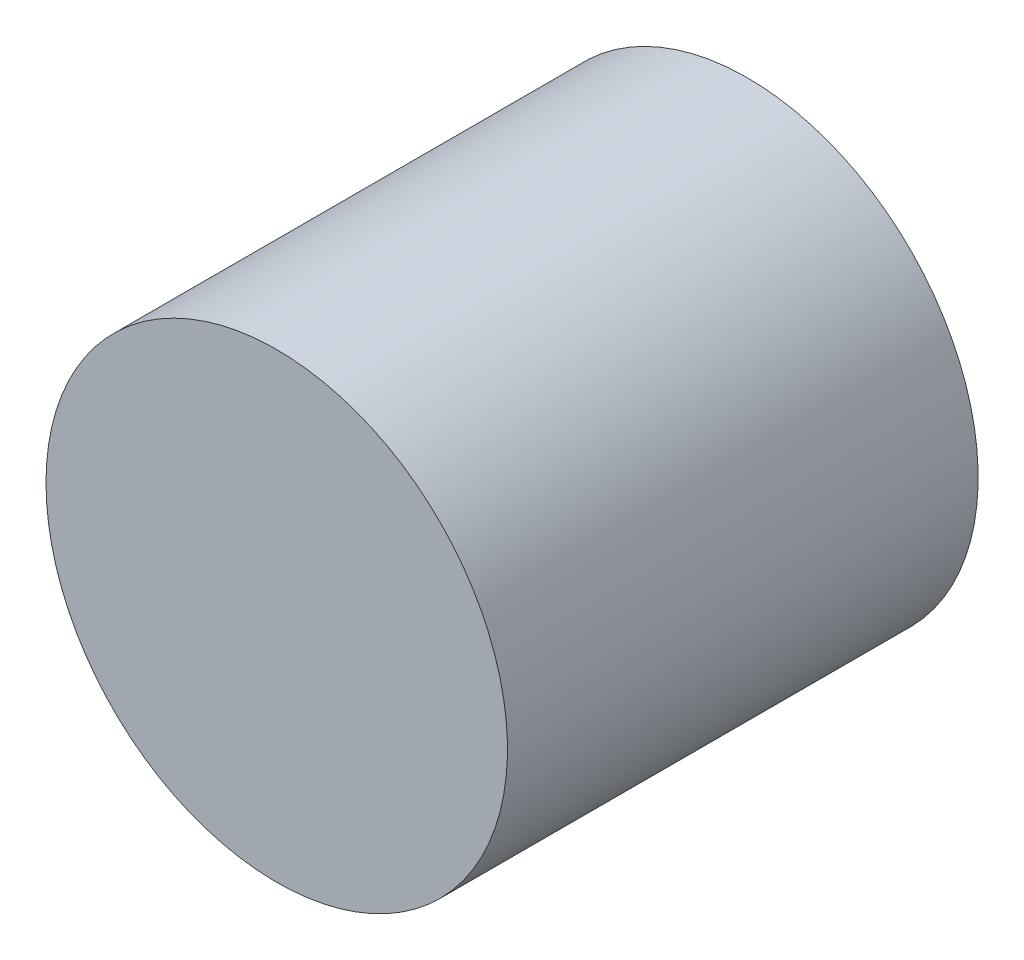
ISO-10303-21;
HEADER;
FILE_DESCRIPTION(('STEP AP214'),'2;1');
FILE_NAME('part.step','',(''),(''),'','','');
FILE_SCHEMA(('AUTOMOTIVE_DESIGN { 1 0 10303 214 1 1 1 1 }'));
ENDSEC;
DATA;
#1=APPLICATION_CONTEXT('core data for automotive mechanical design processes');
#2=APPLICATION_PROTOCOL_DEFINITION('international standard','automotive_design',2000,#1);
#3=PRODUCT_CONTEXT('',#1,'mechanical');
#4=PRODUCT('Part','Part','',(#3));
#5=PRODUCT_RELATED_PRODUCT_CATEGORY('part','',(#4));
#6=PRODUCT_DEFINITION_FORMATION('','',#4);
#7=PRODUCT_DEFINITION_CONTEXT('part definition',#1,'design');
#8=PRODUCT_DEFINITION('design','',#6,#7);
#9=PRODUCT_DEFINITION_SHAPE('','',#8);
#10=(LENGTH_UNIT() NAMED_UNIT(*) SI_UNIT(.MILLI.,.METRE.));
#11=(NAMED_UNIT(*) PLANE_ANGLE_UNIT() SI_UNIT($,.RADIAN.));
#12=(NAMED_UNIT(*) SI_UNIT($,.STERADIAN.) SOLID_ANGLE_UNIT());
#13=UNCERTAINTY_MEASURE_WITH_UNIT(LENGTH_MEASURE(1.E-05),#10,'distance_accuracy_value','');
#14=(GEOMETRIC_REPRESENTATION_CONTEXT(3) GLOBAL_UNCERTAINTY_ASSIGNED_CONTEXT((#13)) GLOBAL_UNIT_ASSIGNED_CONTEXT((#10,
#11,#12)) REPRESENTATION_CONTEXT('',''));
#15=CARTESIAN_POINT('',(0.,0.,0.));
#16=DIRECTION('',(0.,0.,1.));
#17=DIRECTION('',(1.,0.,0.));
#18=AXIS2_PLACEMENT_3D('',#15,#16,#17);
#19=CARTESIAN_POINT('',(5.00000016,0.,0.));
#20=DIRECTION('',(0.,0.,-1.));
#21=DIRECTION('',(-1.,0.,0.));
#22=AXIS2_PLACEMENT_3D('',#19,#20,#21);
#23=PLANE('',#22);
#24=CARTESIAN_POINT('',(0.,0.,0.));
#25=DIRECTION('',(0.,0.,-1.));
#26=DIRECTION('',(-1.,0.,0.));
#27=AXIS2_PLACEMENT_3D('',#24,#25,#26);
#28=CIRCLE('',#27,5.00000016);
#29=CARTESIAN_POINT('',(-5.00000016,0.,0.));
#30=VERTEX_POINT('',#29);
#31=EDGE_CURVE('E18',#30,#30,#28,.F.);
#32=ORIENTED_EDGE('',*,*,#31,.F.);
#33=EDGE_LOOP('',(#32));
#34=FACE_BOUND('',#33,.T.);
#35=ADVANCED_FACE('F15',(#34),#23,.T.);
#36=CARTESIAN_POINT('',(5.00000016,0.,10.19999992));
#37=DIRECTION('',(0.,0.,-1.));
#38=DIRECTION('',(-1.,0.,0.));
#39=AXIS2_PLACEMENT_3D('',#36,#37,#38);
#40=PLANE('',#39);
#41=CARTESIAN_POINT('',(0.,0.,10.19999992));
#42=DIRECTION('',(0.,0.,-1.));
#43=DIRECTION('',(-1.,0.,0.));
#44=AXIS2_PLACEMENT_3D('',#41,#42,#43);
#45=CIRCLE('',#44,5.00000016);
#46=CARTESIAN_POINT('',(-5.00000016,0.,10.19999992));
#47=VERTEX_POINT('',#46);
#48=EDGE_CURVE('E10',#47,#47,#45,.T.);
#49=ORIENTED_EDGE('',*,*,#48,.F.);
#50=EDGE_LOOP('',(#49));
#51=FACE_BOUND('',#50,.T.);
#52=ADVANCED_FACE('F30',(#51),#40,.F.);
#53=CARTESIAN_POINT('',(0.,0.,0.));
#54=DIRECTION('',(0.,0.,-1.));
#55=DIRECTION('',(-1.,0.,0.));
#56=AXIS2_PLACEMENT_3D('',#53,#54,#55);
#57=CYLINDRICAL_SURFACE('',#56,5.00000016);
#58=ORIENTED_EDGE('',*,*,#31,.T.);
#59=EDGE_LOOP('',(#58));
#60=FACE_BOUND('',#59,.T.);
#61=ORIENTED_EDGE('',*,*,#48,.T.);
#62=EDGE_LOOP('',(#61));
#63=FACE_BOUND('',#62,.T.);
#64=ADVANCED_FACE('F27',(#60,#63),#57,.T.);
#65=CLOSED_SHELL('',(#35,#52,#64));
#66=MANIFOLD_SOLID_BREP('B1',#65);
#67=ADVANCED_BREP_SHAPE_REPRESENTATION('',(#18,#66),#14);
#68=SHAPE_DEFINITION_REPRESENTATION(#9,#67);
ENDSEC;
END-ISO-10303-21;
